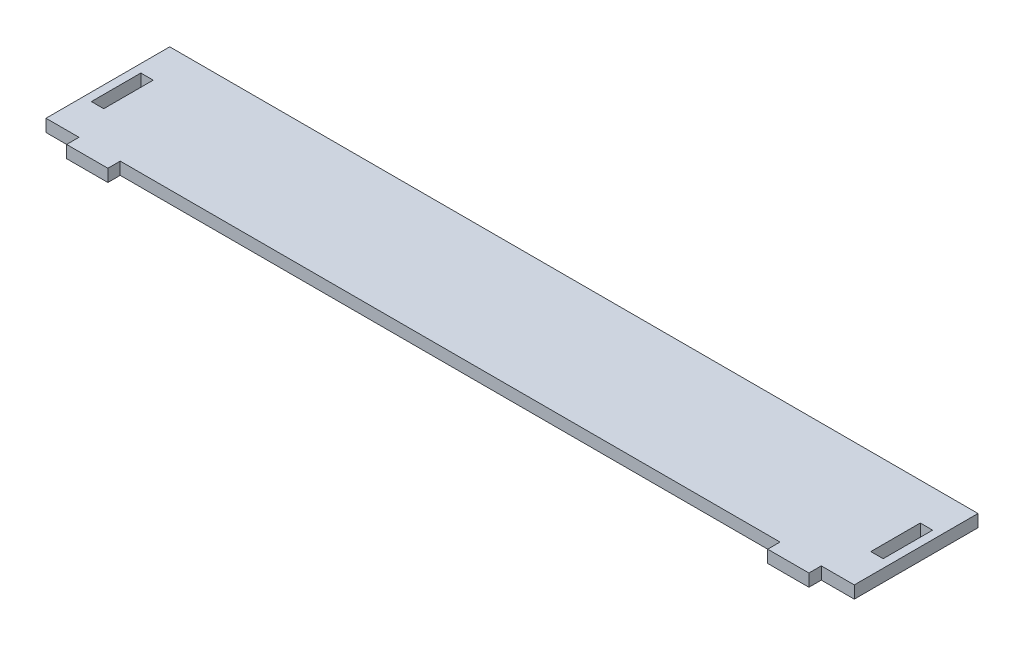
ISO-10303-21;
HEADER;
FILE_DESCRIPTION(('STEP AP214'),'2;1');
FILE_NAME('part.step','',(''),(''),'','','');
FILE_SCHEMA(('AUTOMOTIVE_DESIGN { 1 0 10303 214 1 1 1 1 }'));
ENDSEC;
DATA;
#1=APPLICATION_CONTEXT('core data for automotive mechanical design processes');
#2=APPLICATION_PROTOCOL_DEFINITION('international standard','automotive_design',2000,#1);
#3=PRODUCT_CONTEXT('',#1,'mechanical');
#4=PRODUCT('Part','Part','',(#3));
#5=PRODUCT_RELATED_PRODUCT_CATEGORY('part','',(#4));
#6=PRODUCT_DEFINITION_FORMATION('','',#4);
#7=PRODUCT_DEFINITION_CONTEXT('part definition',#1,'design');
#8=PRODUCT_DEFINITION('design','',#6,#7);
#9=PRODUCT_DEFINITION_SHAPE('','',#8);
#10=(LENGTH_UNIT() NAMED_UNIT(*) SI_UNIT(.MILLI.,.METRE.));
#11=(NAMED_UNIT(*) PLANE_ANGLE_UNIT() SI_UNIT($,.RADIAN.));
#12=(NAMED_UNIT(*) SI_UNIT($,.STERADIAN.) SOLID_ANGLE_UNIT());
#13=UNCERTAINTY_MEASURE_WITH_UNIT(LENGTH_MEASURE(1.E-05),#10,'distance_accuracy_value','');
#14=(GEOMETRIC_REPRESENTATION_CONTEXT(3) GLOBAL_UNCERTAINTY_ASSIGNED_CONTEXT((#13)) GLOBAL_UNIT_ASSIGNED_CONTEXT((#10,
#11,#12)) REPRESENTATION_CONTEXT('',''));
#15=CARTESIAN_POINT('',(0.,0.,0.));
#16=DIRECTION('',(0.,0.,1.));
#17=DIRECTION('',(1.,0.,0.));
#18=AXIS2_PLACEMENT_3D('',#15,#16,#17);
#19=CARTESIAN_POINT('',(-8.,3.,0.));
#20=DIRECTION('',(1.,0.,0.));
#21=DIRECTION('',(0.,0.,-1.));
#22=AXIS2_PLACEMENT_3D('',#19,#20,#21);
#23=PLANE('',#22);
#24=DIRECTION('',(0.,0.,1.));
#25=VECTOR('',#24,1.);
#26=CARTESIAN_POINT('',(-8.,0.,0.));
#27=LINE('',#26,#25);
#28=CARTESIAN_POINT('',(-8.,0.,-30.));
#29=VERTEX_POINT('',#28);
#30=CARTESIAN_POINT('',(-8.,0.,0.));
#31=VERTEX_POINT('',#30);
#32=EDGE_CURVE('E250',#29,#31,#27,.T.);
#33=ORIENTED_EDGE('',*,*,#32,.T.);
#34=DIRECTION('',(0.,-1.,0.));
#35=VECTOR('',#34,1.);
#36=CARTESIAN_POINT('',(-8.,3.,0.));
#37=LINE('',#36,#35);
#38=CARTESIAN_POINT('',(-8.,3.,0.));
#39=VERTEX_POINT('',#38);
#40=EDGE_CURVE('E11',#39,#31,#37,.T.);
#41=ORIENTED_EDGE('',*,*,#40,.F.);
#42=DIRECTION('',(0.,0.,1.));
#43=VECTOR('',#42,1.);
#44=CARTESIAN_POINT('',(-8.,3.,0.));
#45=LINE('',#44,#43);
#46=CARTESIAN_POINT('',(-8.,3.,-30.));
#47=VERTEX_POINT('',#46);
#48=EDGE_CURVE('E387',#47,#39,#45,.T.);
#49=ORIENTED_EDGE('',*,*,#48,.F.);
#50=DIRECTION('',(0.,-1.,0.));
#51=VECTOR('',#50,1.);
#52=CARTESIAN_POINT('',(-8.,3.,-30.));
#53=LINE('',#52,#51);
#54=EDGE_CURVE('E59',#47,#29,#53,.T.);
#55=ORIENTED_EDGE('',*,*,#54,.T.);
#56=EDGE_LOOP('',(#33,#41,#49,#55));
#57=FACE_BOUND('',#56,.T.);
#58=ADVANCED_FACE('F39',(#57),#23,.F.);
#59=CARTESIAN_POINT('',(0.,3.,0.));
#60=DIRECTION('',(0.,0.,-1.));
#61=DIRECTION('',(-1.,0.,0.));
#62=AXIS2_PLACEMENT_3D('',#59,#60,#61);
#63=PLANE('',#62);
#64=DIRECTION('',(1.,0.,0.));
#65=VECTOR('',#64,1.);
#66=CARTESIAN_POINT('',(0.,0.,0.));
#67=LINE('',#66,#65);
#68=CARTESIAN_POINT('',(0.,0.,0.));
#69=VERTEX_POINT('',#68);
#70=EDGE_CURVE('E253',#31,#69,#67,.T.);
#71=ORIENTED_EDGE('',*,*,#70,.T.);
#72=DIRECTION('',(0.,-1.,0.));
#73=VECTOR('',#72,1.);
#74=CARTESIAN_POINT('',(0.,3.,0.));
#75=LINE('',#74,#73);
#76=CARTESIAN_POINT('',(0.,3.,0.));
#77=VERTEX_POINT('',#76);
#78=EDGE_CURVE('E50',#77,#69,#75,.T.);
#79=ORIENTED_EDGE('',*,*,#78,.F.);
#80=DIRECTION('',(1.,0.,0.));
#81=VECTOR('',#80,1.);
#82=CARTESIAN_POINT('',(0.,3.,0.));
#83=LINE('',#82,#81);
#84=EDGE_CURVE('E390',#39,#77,#83,.T.);
#85=ORIENTED_EDGE('',*,*,#84,.F.);
#86=ORIENTED_EDGE('',*,*,#40,.T.);
#87=EDGE_LOOP('',(#71,#79,#85,#86));
#88=FACE_BOUND('',#87,.T.);
#89=ADVANCED_FACE('F431',(#88),#63,.F.);
#90=CARTESIAN_POINT('',(0.,3.,0.));
#91=DIRECTION('',(1.,0.,0.));
#92=DIRECTION('',(0.,0.,-1.));
#93=AXIS2_PLACEMENT_3D('',#90,#91,#92);
#94=PLANE('',#93);
#95=DIRECTION('',(0.,0.,1.));
#96=VECTOR('',#95,1.);
#97=CARTESIAN_POINT('',(0.,0.,0.));
#98=LINE('',#97,#96);
#99=CARTESIAN_POINT('',(0.,0.,3.));
#100=VERTEX_POINT('',#99);
#101=EDGE_CURVE('E256',#69,#100,#98,.T.);
#102=ORIENTED_EDGE('',*,*,#101,.T.);
#103=DIRECTION('',(0.,-1.,0.));
#104=VECTOR('',#103,1.);
#105=CARTESIAN_POINT('',(0.,3.,3.));
#106=LINE('',#105,#104);
#107=CARTESIAN_POINT('',(0.,3.,3.));
#108=VERTEX_POINT('',#107);
#109=EDGE_CURVE('E315',#108,#100,#106,.T.);
#110=ORIENTED_EDGE('',*,*,#109,.F.);
#111=DIRECTION('',(0.,0.,1.));
#112=VECTOR('',#111,1.);
#113=CARTESIAN_POINT('',(0.,3.,0.));
#114=LINE('',#113,#112);
#115=EDGE_CURVE('E393',#77,#108,#114,.T.);
#116=ORIENTED_EDGE('',*,*,#115,.F.);
#117=ORIENTED_EDGE('',*,*,#78,.T.);
#118=EDGE_LOOP('',(#102,#110,#116,#117));
#119=FACE_BOUND('',#118,.T.);
#120=ADVANCED_FACE('F436',(#119),#94,.F.);
#121=CARTESIAN_POINT('',(0.,3.,3.));
#122=DIRECTION('',(0.,0.,-1.));
#123=DIRECTION('',(-1.,0.,0.));
#124=AXIS2_PLACEMENT_3D('',#121,#122,#123);
#125=PLANE('',#124);
#126=DIRECTION('',(1.,0.,0.));
#127=VECTOR('',#126,1.);
#128=CARTESIAN_POINT('',(0.,0.,3.));
#129=LINE('',#128,#127);
#130=CARTESIAN_POINT('',(10.,0.,3.));
#131=VERTEX_POINT('',#130);
#132=EDGE_CURVE('E259',#100,#131,#129,.T.);
#133=ORIENTED_EDGE('',*,*,#132,.T.);
#134=DIRECTION('',(0.,-1.,0.));
#135=VECTOR('',#134,1.);
#136=CARTESIAN_POINT('',(10.,3.,3.));
#137=LINE('',#136,#135);
#138=CARTESIAN_POINT('',(10.,3.,3.));
#139=VERTEX_POINT('',#138);
#140=EDGE_CURVE('E312',#139,#131,#137,.T.);
#141=ORIENTED_EDGE('',*,*,#140,.F.);
#142=DIRECTION('',(1.,0.,0.));
#143=VECTOR('',#142,1.);
#144=CARTESIAN_POINT('',(0.,3.,3.));
#145=LINE('',#144,#143);
#146=EDGE_CURVE('E396',#108,#139,#145,.T.);
#147=ORIENTED_EDGE('',*,*,#146,.F.);
#148=ORIENTED_EDGE('',*,*,#109,.T.);
#149=EDGE_LOOP('',(#133,#141,#147,#148));
#150=FACE_BOUND('',#149,.T.);
#151=ADVANCED_FACE('F523',(#150),#125,.F.);
#152=CARTESIAN_POINT('',(10.,3.,0.));
#153=DIRECTION('',(1.,0.,0.));
#154=DIRECTION('',(0.,0.,-1.));
#155=AXIS2_PLACEMENT_3D('',#152,#153,#154);
#156=PLANE('',#155);
#157=DIRECTION('',(0.,0.,1.));
#158=VECTOR('',#157,1.);
#159=CARTESIAN_POINT('',(10.,0.,0.));
#160=LINE('',#159,#158);
#161=CARTESIAN_POINT('',(10.,0.,0.));
#162=VERTEX_POINT('',#161);
#163=EDGE_CURVE('E263',#162,#131,#160,.T.);
#164=ORIENTED_EDGE('',*,*,#163,.F.);
#165=DIRECTION('',(0.,-1.,0.));
#166=VECTOR('',#165,1.);
#167=CARTESIAN_POINT('',(10.,3.,0.));
#168=LINE('',#167,#166);
#169=CARTESIAN_POINT('',(10.,3.,0.));
#170=VERTEX_POINT('',#169);
#171=EDGE_CURVE('E309',#170,#162,#168,.T.);
#172=ORIENTED_EDGE('',*,*,#171,.F.);
#173=DIRECTION('',(0.,0.,1.));
#174=VECTOR('',#173,1.);
#175=CARTESIAN_POINT('',(10.,3.,0.));
#176=LINE('',#175,#174);
#177=EDGE_CURVE('E399',#170,#139,#176,.T.);
#178=ORIENTED_EDGE('',*,*,#177,.T.);
#179=ORIENTED_EDGE('',*,*,#140,.T.);
#180=EDGE_LOOP('',(#164,#172,#178,#179));
#181=FACE_BOUND('',#180,.T.);
#182=ADVANCED_FACE('F515',(#181),#156,.T.);
#183=CARTESIAN_POINT('',(0.,3.,0.));
#184=DIRECTION('',(0.,0.,-1.));
#185=DIRECTION('',(-1.,0.,0.));
#186=AXIS2_PLACEMENT_3D('',#183,#184,#185);
#187=PLANE('',#186);
#188=DIRECTION('',(1.,0.,0.));
#189=VECTOR('',#188,1.);
#190=CARTESIAN_POINT('',(0.,0.,0.));
#191=LINE('',#190,#189);
#192=CARTESIAN_POINT('',(170.,0.,0.));
#193=VERTEX_POINT('',#192);
#194=EDGE_CURVE('E267',#162,#193,#191,.T.);
#195=ORIENTED_EDGE('',*,*,#194,.T.);
#196=DIRECTION('',(0.,-1.,0.));
#197=VECTOR('',#196,1.);
#198=CARTESIAN_POINT('',(170.,3.,0.));
#199=LINE('',#198,#197);
#200=CARTESIAN_POINT('',(170.,3.,0.));
#201=VERTEX_POINT('',#200);
#202=EDGE_CURVE('E305',#201,#193,#199,.T.);
#203=ORIENTED_EDGE('',*,*,#202,.F.);
#204=DIRECTION('',(1.,0.,0.));
#205=VECTOR('',#204,1.);
#206=CARTESIAN_POINT('',(0.,3.,0.));
#207=LINE('',#206,#205);
#208=EDGE_CURVE('E403',#170,#201,#207,.T.);
#209=ORIENTED_EDGE('',*,*,#208,.F.);
#210=ORIENTED_EDGE('',*,*,#171,.T.);
#211=EDGE_LOOP('',(#195,#203,#209,#210));
#212=FACE_BOUND('',#211,.T.);
#213=ADVANCED_FACE('F507',(#212),#187,.F.);
#214=CARTESIAN_POINT('',(170.,3.,0.));
#215=DIRECTION('',(1.,0.,0.));
#216=DIRECTION('',(0.,0.,-1.));
#217=AXIS2_PLACEMENT_3D('',#214,#215,#216);
#218=PLANE('',#217);
#219=DIRECTION('',(0.,0.,1.));
#220=VECTOR('',#219,1.);
#221=CARTESIAN_POINT('',(170.,0.,0.));
#222=LINE('',#221,#220);
#223=CARTESIAN_POINT('',(170.,0.,3.));
#224=VERTEX_POINT('',#223);
#225=EDGE_CURVE('E270',#193,#224,#222,.T.);
#226=ORIENTED_EDGE('',*,*,#225,.T.);
#227=DIRECTION('',(0.,-1.,0.));
#228=VECTOR('',#227,1.);
#229=CARTESIAN_POINT('',(170.,3.,3.));
#230=LINE('',#229,#228);
#231=CARTESIAN_POINT('',(170.,3.,3.));
#232=VERTEX_POINT('',#231);
#233=EDGE_CURVE('E302',#232,#224,#230,.T.);
#234=ORIENTED_EDGE('',*,*,#233,.F.);
#235=DIRECTION('',(0.,0.,1.));
#236=VECTOR('',#235,1.);
#237=CARTESIAN_POINT('',(170.,3.,0.));
#238=LINE('',#237,#236);
#239=EDGE_CURVE('E406',#201,#232,#238,.T.);
#240=ORIENTED_EDGE('',*,*,#239,.F.);
#241=ORIENTED_EDGE('',*,*,#202,.T.);
#242=EDGE_LOOP('',(#226,#234,#240,#241));
#243=FACE_BOUND('',#242,.T.);
#244=ADVANCED_FACE('F499',(#243),#218,.F.);
#245=CARTESIAN_POINT('',(0.,3.,3.));
#246=DIRECTION('',(0.,0.,1.));
#247=DIRECTION('',(1.,0.,0.));
#248=AXIS2_PLACEMENT_3D('',#245,#246,#247);
#249=PLANE('',#248);
#250=DIRECTION('',(-1.,0.,0.));
#251=VECTOR('',#250,1.);
#252=CARTESIAN_POINT('',(0.,0.,3.));
#253=LINE('',#252,#251);
#254=CARTESIAN_POINT('',(180.,0.,3.));
#255=VERTEX_POINT('',#254);
#256=EDGE_CURVE('E274',#255,#224,#253,.T.);
#257=ORIENTED_EDGE('',*,*,#256,.F.);
#258=DIRECTION('',(0.,-1.,0.));
#259=VECTOR('',#258,1.);
#260=CARTESIAN_POINT('',(180.,3.,3.));
#261=LINE('',#260,#259);
#262=CARTESIAN_POINT('',(180.,3.,3.));
#263=VERTEX_POINT('',#262);
#264=EDGE_CURVE('E299',#263,#255,#261,.T.);
#265=ORIENTED_EDGE('',*,*,#264,.F.);
#266=DIRECTION('',(-1.,0.,0.));
#267=VECTOR('',#266,1.);
#268=CARTESIAN_POINT('',(0.,3.,3.));
#269=LINE('',#268,#267);
#270=EDGE_CURVE('E409',#263,#232,#269,.T.);
#271=ORIENTED_EDGE('',*,*,#270,.T.);
#272=ORIENTED_EDGE('',*,*,#233,.T.);
#273=EDGE_LOOP('',(#257,#265,#271,#272));
#274=FACE_BOUND('',#273,.T.);
#275=ADVANCED_FACE('F492',(#274),#249,.T.);
#276=CARTESIAN_POINT('',(180.,3.,0.));
#277=DIRECTION('',(1.,0.,0.));
#278=DIRECTION('',(0.,0.,-1.));
#279=AXIS2_PLACEMENT_3D('',#276,#277,#278);
#280=PLANE('',#279);
#281=DIRECTION('',(0.,0.,1.));
#282=VECTOR('',#281,1.);
#283=CARTESIAN_POINT('',(180.,0.,0.));
#284=LINE('',#283,#282);
#285=CARTESIAN_POINT('',(180.,0.,0.));
#286=VERTEX_POINT('',#285);
#287=EDGE_CURVE('E278',#286,#255,#284,.T.);
#288=ORIENTED_EDGE('',*,*,#287,.F.);
#289=DIRECTION('',(0.,-1.,0.));
#290=VECTOR('',#289,1.);
#291=CARTESIAN_POINT('',(180.,3.,0.));
#292=LINE('',#291,#290);
#293=CARTESIAN_POINT('',(180.,3.,0.));
#294=VERTEX_POINT('',#293);
#295=EDGE_CURVE('E196',#294,#286,#292,.T.);
#296=ORIENTED_EDGE('',*,*,#295,.F.);
#297=DIRECTION('',(0.,0.,1.));
#298=VECTOR('',#297,1.);
#299=CARTESIAN_POINT('',(180.,3.,0.));
#300=LINE('',#299,#298);
#301=EDGE_CURVE('E207',#294,#263,#300,.T.);
#302=ORIENTED_EDGE('',*,*,#301,.T.);
#303=ORIENTED_EDGE('',*,*,#264,.T.);
#304=EDGE_LOOP('',(#288,#296,#302,#303));
#305=FACE_BOUND('',#304,.T.);
#306=ADVANCED_FACE('F415',(#305),#280,.T.);
#307=CARTESIAN_POINT('',(0.,3.,0.));
#308=DIRECTION('',(0.,0.,1.));
#309=DIRECTION('',(1.,0.,0.));
#310=AXIS2_PLACEMENT_3D('',#307,#308,#309);
#311=PLANE('',#310);
#312=DIRECTION('',(-1.,0.,0.));
#313=VECTOR('',#312,1.);
#314=CARTESIAN_POINT('',(0.,0.,0.));
#315=LINE('',#314,#313);
#316=CARTESIAN_POINT('',(188.,0.,0.));
#317=VERTEX_POINT('',#316);
#318=EDGE_CURVE('E191',#317,#286,#315,.T.);
#319=ORIENTED_EDGE('',*,*,#318,.F.);
#320=DIRECTION('',(0.,-1.,0.));
#321=VECTOR('',#320,1.);
#322=CARTESIAN_POINT('',(188.,3.,0.));
#323=LINE('',#322,#321);
#324=CARTESIAN_POINT('',(188.,3.,0.));
#325=VERTEX_POINT('',#324);
#326=EDGE_CURVE('E186',#325,#317,#323,.T.);
#327=ORIENTED_EDGE('',*,*,#326,.F.);
#328=DIRECTION('',(-1.,0.,0.));
#329=VECTOR('',#328,1.);
#330=CARTESIAN_POINT('',(0.,3.,0.));
#331=LINE('',#330,#329);
#332=EDGE_CURVE('E189',#325,#294,#331,.T.);
#333=ORIENTED_EDGE('',*,*,#332,.T.);
#334=ORIENTED_EDGE('',*,*,#295,.T.);
#335=EDGE_LOOP('',(#319,#327,#333,#334));
#336=FACE_BOUND('',#335,.T.);
#337=ADVANCED_FACE('F188',(#336),#311,.T.);
#338=CARTESIAN_POINT('',(188.,3.,0.));
#339=DIRECTION('',(1.,0.,0.));
#340=DIRECTION('',(0.,0.,-1.));
#341=AXIS2_PLACEMENT_3D('',#338,#339,#340);
#342=PLANE('',#341);
#343=DIRECTION('',(0.,0.,1.));
#344=VECTOR('',#343,1.);
#345=CARTESIAN_POINT('',(188.,0.,0.));
#346=LINE('',#345,#344);
#347=CARTESIAN_POINT('',(188.,0.,-30.));
#348=VERTEX_POINT('',#347);
#349=EDGE_CURVE('E284',#348,#317,#346,.T.);
#350=ORIENTED_EDGE('',*,*,#349,.F.);
#351=DIRECTION('',(0.,-1.,0.));
#352=VECTOR('',#351,1.);
#353=CARTESIAN_POINT('',(188.,3.,-30.));
#354=LINE('',#353,#352);
#355=CARTESIAN_POINT('',(188.,3.,-30.));
#356=VERTEX_POINT('',#355);
#357=EDGE_CURVE('E121',#356,#348,#354,.T.);
#358=ORIENTED_EDGE('',*,*,#357,.F.);
#359=DIRECTION('',(0.,0.,1.));
#360=VECTOR('',#359,1.);
#361=CARTESIAN_POINT('',(188.,3.,0.));
#362=LINE('',#361,#360);
#363=EDGE_CURVE('E204',#356,#325,#362,.T.);
#364=ORIENTED_EDGE('',*,*,#363,.T.);
#365=ORIENTED_EDGE('',*,*,#326,.T.);
#366=EDGE_LOOP('',(#350,#358,#364,#365));
#367=FACE_BOUND('',#366,.T.);
#368=ADVANCED_FACE('F210',(#367),#342,.T.);
#369=CARTESIAN_POINT('',(0.,3.,-9.));
#370=DIRECTION('',(0.,0.,-1.));
#371=DIRECTION('',(-1.,0.,0.));
#372=AXIS2_PLACEMENT_3D('',#369,#370,#371);
#373=PLANE('',#372);
#374=DIRECTION('',(1.,0.,0.));
#375=VECTOR('',#374,1.);
#376=CARTESIAN_POINT('',(0.,0.,-9.));
#377=LINE('',#376,#375);
#378=CARTESIAN_POINT('',(-6.,0.,-9.));
#379=VERTEX_POINT('',#378);
#380=CARTESIAN_POINT('',(-3.,0.,-9.));
#381=VERTEX_POINT('',#380);
#382=EDGE_CURVE('E234',#379,#381,#377,.T.);
#383=ORIENTED_EDGE('',*,*,#382,.F.);
#384=DIRECTION('',(0.,-1.,0.));
#385=VECTOR('',#384,1.);
#386=CARTESIAN_POINT('',(-6.,3.,-9.));
#387=LINE('',#386,#385);
#388=CARTESIAN_POINT('',(-6.,3.,-9.));
#389=VERTEX_POINT('',#388);
#390=EDGE_CURVE('E294',#389,#379,#387,.T.);
#391=ORIENTED_EDGE('',*,*,#390,.F.);
#392=DIRECTION('',(1.,0.,0.));
#393=VECTOR('',#392,1.);
#394=CARTESIAN_POINT('',(0.,3.,-9.));
#395=LINE('',#394,#393);
#396=CARTESIAN_POINT('',(-3.,3.,-9.));
#397=VERTEX_POINT('',#396);
#398=EDGE_CURVE('E363',#389,#397,#395,.T.);
#399=ORIENTED_EDGE('',*,*,#398,.T.);
#400=DIRECTION('',(0.,-1.,0.));
#401=VECTOR('',#400,1.);
#402=CARTESIAN_POINT('',(-3.,3.,-9.));
#403=LINE('',#402,#401);
#404=EDGE_CURVE('E322',#397,#381,#403,.T.);
#405=ORIENTED_EDGE('',*,*,#404,.T.);
#406=EDGE_LOOP('',(#383,#391,#399,#405));
#407=FACE_BOUND('',#406,.T.);
#408=ADVANCED_FACE('F451',(#407),#373,.T.);
#409=CARTESIAN_POINT('',(-6.,3.,0.));
#410=DIRECTION('',(1.,0.,0.));
#411=DIRECTION('',(0.,0.,-1.));
#412=AXIS2_PLACEMENT_3D('',#409,#410,#411);
#413=PLANE('',#412);
#414=DIRECTION('',(0.,0.,1.));
#415=VECTOR('',#414,1.);
#416=CARTESIAN_POINT('',(-6.,0.,0.));
#417=LINE('',#416,#415);
#418=CARTESIAN_POINT('',(-6.,0.,-21.));
#419=VERTEX_POINT('',#418);
#420=EDGE_CURVE('E238',#419,#379,#417,.T.);
#421=ORIENTED_EDGE('',*,*,#420,.F.);
#422=DIRECTION('',(0.,-1.,0.));
#423=VECTOR('',#422,1.);
#424=CARTESIAN_POINT('',(-6.,3.,-21.));
#425=LINE('',#424,#423);
#426=CARTESIAN_POINT('',(-6.,3.,-21.));
#427=VERTEX_POINT('',#426);
#428=EDGE_CURVE('E328',#427,#419,#425,.T.);
#429=ORIENTED_EDGE('',*,*,#428,.F.);
#430=DIRECTION('',(0.,0.,1.));
#431=VECTOR('',#430,1.);
#432=CARTESIAN_POINT('',(-6.,3.,0.));
#433=LINE('',#432,#431);
#434=EDGE_CURVE('E375',#427,#389,#433,.T.);
#435=ORIENTED_EDGE('',*,*,#434,.T.);
#436=ORIENTED_EDGE('',*,*,#390,.T.);
#437=EDGE_LOOP('',(#421,#429,#435,#436));
#438=FACE_BOUND('',#437,.T.);
#439=ADVANCED_FACE('F447',(#438),#413,.T.);
#440=CARTESIAN_POINT('',(0.,3.,-21.));
#441=DIRECTION('',(0.,0.,1.));
#442=DIRECTION('',(1.,0.,0.));
#443=AXIS2_PLACEMENT_3D('',#440,#441,#442);
#444=PLANE('',#443);
#445=DIRECTION('',(-1.,0.,0.));
#446=VECTOR('',#445,1.);
#447=CARTESIAN_POINT('',(0.,0.,-21.));
#448=LINE('',#447,#446);
#449=CARTESIAN_POINT('',(-3.,0.,-21.));
#450=VERTEX_POINT('',#449);
#451=EDGE_CURVE('E242',#450,#419,#448,.T.);
#452=ORIENTED_EDGE('',*,*,#451,.F.);
#453=DIRECTION('',(0.,-1.,0.));
#454=VECTOR('',#453,1.);
#455=CARTESIAN_POINT('',(-3.,3.,-21.));
#456=LINE('',#455,#454);
#457=CARTESIAN_POINT('',(-3.,3.,-21.));
#458=VERTEX_POINT('',#457);
#459=EDGE_CURVE('E325',#458,#450,#456,.T.);
#460=ORIENTED_EDGE('',*,*,#459,.F.);
#461=DIRECTION('',(-1.,0.,0.));
#462=VECTOR('',#461,1.);
#463=CARTESIAN_POINT('',(0.,3.,-21.));
#464=LINE('',#463,#462);
#465=EDGE_CURVE('E379',#458,#427,#464,.T.);
#466=ORIENTED_EDGE('',*,*,#465,.T.);
#467=ORIENTED_EDGE('',*,*,#428,.T.);
#468=EDGE_LOOP('',(#452,#460,#466,#467));
#469=FACE_BOUND('',#468,.T.);
#470=ADVANCED_FACE('F444',(#469),#444,.T.);
#471=CARTESIAN_POINT('',(186.,3.,0.));
#472=DIRECTION('',(1.,0.,0.));
#473=DIRECTION('',(0.,0.,-1.));
#474=AXIS2_PLACEMENT_3D('',#471,#472,#473);
#475=PLANE('',#474);
#476=DIRECTION('',(0.,0.,1.));
#477=VECTOR('',#476,1.);
#478=CARTESIAN_POINT('',(186.,0.,0.));
#479=LINE('',#478,#477);
#480=CARTESIAN_POINT('',(186.,0.,-21.));
#481=VERTEX_POINT('',#480);
#482=CARTESIAN_POINT('',(186.,0.,-9.));
#483=VERTEX_POINT('',#482);
#484=EDGE_CURVE('E219',#481,#483,#479,.T.);
#485=ORIENTED_EDGE('',*,*,#484,.T.);
#486=DIRECTION('',(0.,-1.,0.));
#487=VECTOR('',#486,1.);
#488=CARTESIAN_POINT('',(186.,3.,-9.));
#489=LINE('',#488,#487);
#490=CARTESIAN_POINT('',(186.,3.,-9.));
#491=VERTEX_POINT('',#490);
#492=EDGE_CURVE('E43',#491,#483,#489,.T.);
#493=ORIENTED_EDGE('',*,*,#492,.F.);
#494=DIRECTION('',(0.,0.,1.));
#495=VECTOR('',#494,1.);
#496=CARTESIAN_POINT('',(186.,3.,0.));
#497=LINE('',#496,#495);
#498=CARTESIAN_POINT('',(186.,3.,-21.));
#499=VERTEX_POINT('',#498);
#500=EDGE_CURVE('E291',#499,#491,#497,.T.);
#501=ORIENTED_EDGE('',*,*,#500,.F.);
#502=DIRECTION('',(0.,-1.,0.));
#503=VECTOR('',#502,1.);
#504=CARTESIAN_POINT('',(186.,3.,-21.));
#505=LINE('',#504,#503);
#506=EDGE_CURVE('E215',#499,#481,#505,.T.);
#507=ORIENTED_EDGE('',*,*,#506,.T.);
#508=EDGE_LOOP('',(#485,#493,#501,#507));
#509=FACE_BOUND('',#508,.T.);
#510=ADVANCED_FACE('F41',(#509),#475,.F.);
#511=CARTESIAN_POINT('',(0.,3.,-9.));
#512=DIRECTION('',(0.,0.,1.));
#513=DIRECTION('',(1.,0.,0.));
#514=AXIS2_PLACEMENT_3D('',#511,#512,#513);
#515=PLANE('',#514);
#516=DIRECTION('',(-1.,0.,0.));
#517=VECTOR('',#516,1.);
#518=CARTESIAN_POINT('',(0.,0.,-9.));
#519=LINE('',#518,#517);
#520=CARTESIAN_POINT('',(183.,0.,-9.));
#521=VERTEX_POINT('',#520);
#522=EDGE_CURVE('E223',#483,#521,#519,.T.);
#523=ORIENTED_EDGE('',*,*,#522,.T.);
#524=DIRECTION('',(0.,-1.,0.));
#525=VECTOR('',#524,1.);
#526=CARTESIAN_POINT('',(183.,3.,-9.));
#527=LINE('',#526,#525);
#528=CARTESIAN_POINT('',(183.,3.,-9.));
#529=VERTEX_POINT('',#528);
#530=EDGE_CURVE('E338',#529,#521,#527,.T.);
#531=ORIENTED_EDGE('',*,*,#530,.F.);
#532=DIRECTION('',(-1.,0.,0.));
#533=VECTOR('',#532,1.);
#534=CARTESIAN_POINT('',(0.,3.,-9.));
#535=LINE('',#534,#533);
#536=EDGE_CURVE('E134',#491,#529,#535,.T.);
#537=ORIENTED_EDGE('',*,*,#536,.F.);
#538=ORIENTED_EDGE('',*,*,#492,.T.);
#539=EDGE_LOOP('',(#523,#531,#537,#538));
#540=FACE_BOUND('',#539,.T.);
#541=ADVANCED_FACE('F345',(#540),#515,.F.);
#542=CARTESIAN_POINT('',(183.,3.,0.));
#543=DIRECTION('',(1.,0.,0.));
#544=DIRECTION('',(0.,0.,-1.));
#545=AXIS2_PLACEMENT_3D('',#542,#543,#544);
#546=PLANE('',#545);
#547=DIRECTION('',(0.,0.,1.));
#548=VECTOR('',#547,1.);
#549=CARTESIAN_POINT('',(183.,0.,0.));
#550=LINE('',#549,#548);
#551=CARTESIAN_POINT('',(183.,0.,-21.));
#552=VERTEX_POINT('',#551);
#553=EDGE_CURVE('E227',#552,#521,#550,.T.);
#554=ORIENTED_EDGE('',*,*,#553,.F.);
#555=DIRECTION('',(0.,-1.,0.));
#556=VECTOR('',#555,1.);
#557=CARTESIAN_POINT('',(183.,3.,-21.));
#558=LINE('',#557,#556);
#559=CARTESIAN_POINT('',(183.,3.,-21.));
#560=VERTEX_POINT('',#559);
#561=EDGE_CURVE('E336',#560,#552,#558,.T.);
#562=ORIENTED_EDGE('',*,*,#561,.F.);
#563=DIRECTION('',(0.,0.,1.));
#564=VECTOR('',#563,1.);
#565=CARTESIAN_POINT('',(183.,3.,0.));
#566=LINE('',#565,#564);
#567=EDGE_CURVE('E357',#560,#529,#566,.T.);
#568=ORIENTED_EDGE('',*,*,#567,.T.);
#569=ORIENTED_EDGE('',*,*,#530,.T.);
#570=EDGE_LOOP('',(#554,#562,#568,#569));
#571=FACE_BOUND('',#570,.T.);
#572=ADVANCED_FACE('F354',(#571),#546,.T.);
#573=CARTESIAN_POINT('',(-3.,3.,0.));
#574=DIRECTION('',(-1.,0.,0.));
#575=DIRECTION('',(0.,0.,1.));
#576=AXIS2_PLACEMENT_3D('',#573,#574,#575);
#577=PLANE('',#576);
#578=DIRECTION('',(0.,0.,-1.));
#579=VECTOR('',#578,1.);
#580=CARTESIAN_POINT('',(-3.,0.,0.));
#581=LINE('',#580,#579);
#582=EDGE_CURVE('E246',#381,#450,#581,.T.);
#583=ORIENTED_EDGE('',*,*,#582,.F.);
#584=ORIENTED_EDGE('',*,*,#404,.F.);
#585=DIRECTION('',(0.,0.,-1.));
#586=VECTOR('',#585,1.);
#587=CARTESIAN_POINT('',(-3.,3.,0.));
#588=LINE('',#587,#586);
#589=EDGE_CURVE('E383',#397,#458,#588,.T.);
#590=ORIENTED_EDGE('',*,*,#589,.T.);
#591=ORIENTED_EDGE('',*,*,#459,.T.);
#592=EDGE_LOOP('',(#583,#584,#590,#591));
#593=FACE_BOUND('',#592,.T.);
#594=ADVANCED_FACE('F426',(#593),#577,.T.);
#595=CARTESIAN_POINT('',(0.,3.,-21.));
#596=DIRECTION('',(0.,0.,-1.));
#597=DIRECTION('',(-1.,0.,0.));
#598=AXIS2_PLACEMENT_3D('',#595,#596,#597);
#599=PLANE('',#598);
#600=DIRECTION('',(1.,0.,0.));
#601=VECTOR('',#600,1.);
#602=CARTESIAN_POINT('',(0.,0.,-21.));
#603=LINE('',#602,#601);
#604=EDGE_CURVE('E231',#552,#481,#603,.T.);
#605=ORIENTED_EDGE('',*,*,#604,.T.);
#606=ORIENTED_EDGE('',*,*,#506,.F.);
#607=DIRECTION('',(1.,0.,0.));
#608=VECTOR('',#607,1.);
#609=CARTESIAN_POINT('',(0.,3.,-21.));
#610=LINE('',#609,#608);
#611=EDGE_CURVE('E359',#560,#499,#610,.T.);
#612=ORIENTED_EDGE('',*,*,#611,.F.);
#613=ORIENTED_EDGE('',*,*,#561,.T.);
#614=EDGE_LOOP('',(#605,#606,#612,#613));
#615=FACE_BOUND('',#614,.T.);
#616=ADVANCED_FACE('F360',(#615),#599,.F.);
#617=CARTESIAN_POINT('',(0.,3.,-30.));
#618=DIRECTION('',(0.,0.,-1.));
#619=DIRECTION('',(-1.,0.,0.));
#620=AXIS2_PLACEMENT_3D('',#617,#618,#619);
#621=PLANE('',#620);
#622=DIRECTION('',(1.,0.,0.));
#623=VECTOR('',#622,1.);
#624=CARTESIAN_POINT('',(0.,0.,-30.));
#625=LINE('',#624,#623);
#626=EDGE_CURVE('E287',#29,#348,#625,.T.);
#627=ORIENTED_EDGE('',*,*,#626,.F.);
#628=ORIENTED_EDGE('',*,*,#54,.F.);
#629=DIRECTION('',(1.,0.,0.));
#630=VECTOR('',#629,1.);
#631=CARTESIAN_POINT('',(0.,3.,-30.));
#632=LINE('',#631,#630);
#633=EDGE_CURVE('E212',#47,#356,#632,.T.);
#634=ORIENTED_EDGE('',*,*,#633,.T.);
#635=ORIENTED_EDGE('',*,*,#357,.T.);
#636=EDGE_LOOP('',(#627,#628,#634,#635));
#637=FACE_BOUND('',#636,.T.);
#638=ADVANCED_FACE('F418',(#637),#621,.T.);
#639=CARTESIAN_POINT('',(0.,3.,0.));
#640=DIRECTION('',(0.,1.,0.));
#641=DIRECTION('',(0.,0.,1.));
#642=AXIS2_PLACEMENT_3D('',#639,#640,#641);
#643=PLANE('',#642);
#644=ORIENTED_EDGE('',*,*,#500,.T.);
#645=ORIENTED_EDGE('',*,*,#536,.T.);
#646=ORIENTED_EDGE('',*,*,#567,.F.);
#647=ORIENTED_EDGE('',*,*,#611,.T.);
#648=EDGE_LOOP('',(#644,#645,#646,#647));
#649=FACE_BOUND('',#648,.T.);
#650=ORIENTED_EDGE('',*,*,#398,.F.);
#651=ORIENTED_EDGE('',*,*,#434,.F.);
#652=ORIENTED_EDGE('',*,*,#465,.F.);
#653=ORIENTED_EDGE('',*,*,#589,.F.);
#654=EDGE_LOOP('',(#650,#651,#652,#653));
#655=FACE_BOUND('',#654,.T.);
#656=ORIENTED_EDGE('',*,*,#48,.T.);
#657=ORIENTED_EDGE('',*,*,#84,.T.);
#658=ORIENTED_EDGE('',*,*,#115,.T.);
#659=ORIENTED_EDGE('',*,*,#146,.T.);
#660=ORIENTED_EDGE('',*,*,#177,.F.);
#661=ORIENTED_EDGE('',*,*,#208,.T.);
#662=ORIENTED_EDGE('',*,*,#239,.T.);
#663=ORIENTED_EDGE('',*,*,#270,.F.);
#664=ORIENTED_EDGE('',*,*,#301,.F.);
#665=ORIENTED_EDGE('',*,*,#332,.F.);
#666=ORIENTED_EDGE('',*,*,#363,.F.);
#667=ORIENTED_EDGE('',*,*,#633,.F.);
#668=EDGE_LOOP('',(#656,#657,#658,#659,#660,#661,#662,#663,#664,#665,#666,#667));
#669=FACE_BOUND('',#668,.T.);
#670=ADVANCED_FACE('F202',(#649,#655,#669),#643,.T.);
#671=CARTESIAN_POINT('',(0.,0.,0.));
#672=DIRECTION('',(0.,1.,0.));
#673=DIRECTION('',(0.,0.,1.));
#674=AXIS2_PLACEMENT_3D('',#671,#672,#673);
#675=PLANE('',#674);
#676=ORIENTED_EDGE('',*,*,#484,.F.);
#677=ORIENTED_EDGE('',*,*,#604,.F.);
#678=ORIENTED_EDGE('',*,*,#553,.T.);
#679=ORIENTED_EDGE('',*,*,#522,.F.);
#680=EDGE_LOOP('',(#676,#677,#678,#679));
#681=FACE_BOUND('',#680,.T.);
#682=ORIENTED_EDGE('',*,*,#382,.T.);
#683=ORIENTED_EDGE('',*,*,#582,.T.);
#684=ORIENTED_EDGE('',*,*,#451,.T.);
#685=ORIENTED_EDGE('',*,*,#420,.T.);
#686=EDGE_LOOP('',(#682,#683,#684,#685));
#687=FACE_BOUND('',#686,.T.);
#688=ORIENTED_EDGE('',*,*,#32,.F.);
#689=ORIENTED_EDGE('',*,*,#626,.T.);
#690=ORIENTED_EDGE('',*,*,#349,.T.);
#691=ORIENTED_EDGE('',*,*,#318,.T.);
#692=ORIENTED_EDGE('',*,*,#287,.T.);
#693=ORIENTED_EDGE('',*,*,#256,.T.);
#694=ORIENTED_EDGE('',*,*,#225,.F.);
#695=ORIENTED_EDGE('',*,*,#194,.F.);
#696=ORIENTED_EDGE('',*,*,#163,.T.);
#697=ORIENTED_EDGE('',*,*,#132,.F.);
#698=ORIENTED_EDGE('',*,*,#101,.F.);
#699=ORIENTED_EDGE('',*,*,#70,.F.);
#700=EDGE_LOOP('',(#688,#689,#690,#691,#692,#693,#694,#695,#696,#697,#698,#699));
#701=FACE_BOUND('',#700,.T.);
#702=ADVANCED_FACE('F352',(#681,#687,#701),#675,.F.);
#703=CLOSED_SHELL('',(#58,#89,#120,#151,#182,#213,#244,#275,#306,#337,#368,#408,#439,#470,#510,
#541,#572,#594,#616,#638,#670,#702));
#704=MANIFOLD_SOLID_BREP('B2',#703);
#705=ADVANCED_BREP_SHAPE_REPRESENTATION('',(#18,#704),#14);
#706=SHAPE_DEFINITION_REPRESENTATION(#9,#705);
ENDSEC;
END-ISO-10303-21;
